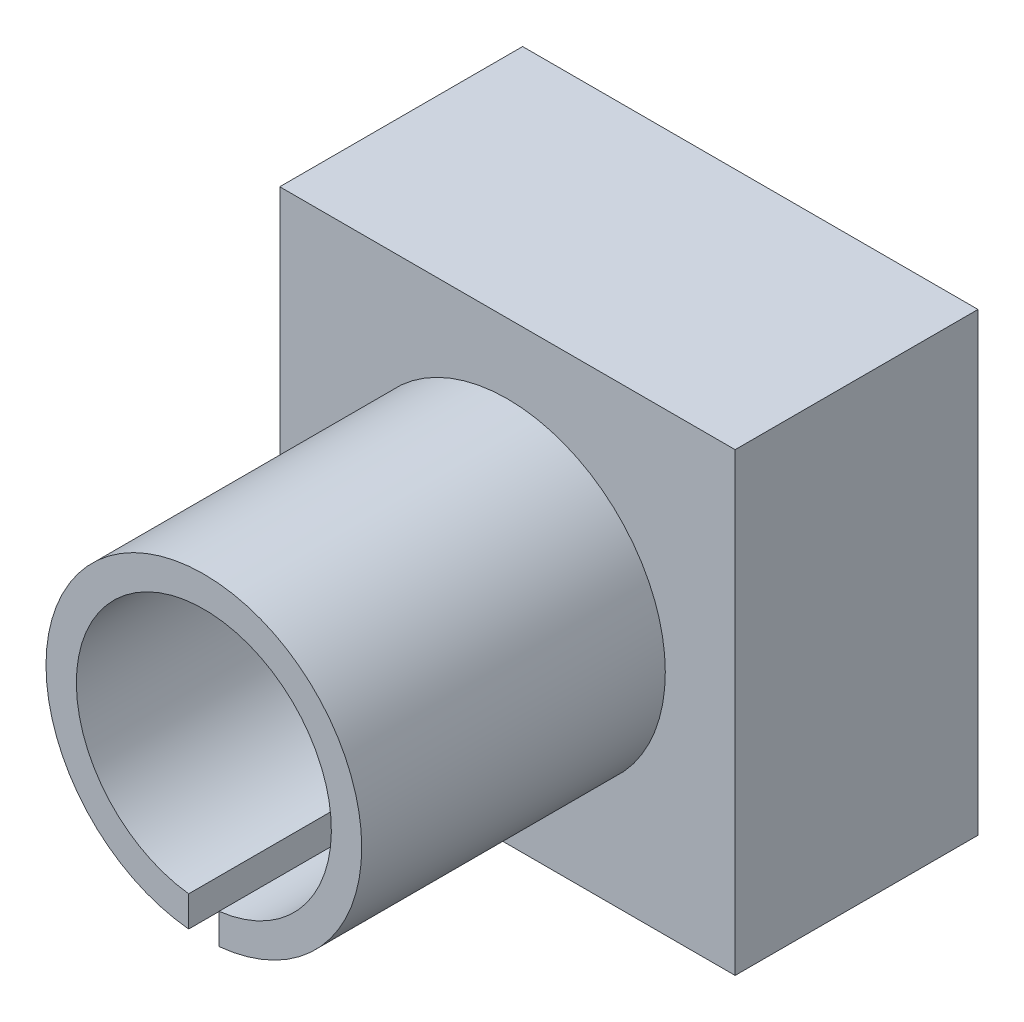
ISO-10303-21;
HEADER;
FILE_DESCRIPTION(('STEP AP214'),'2;1');
FILE_NAME('part.step','',(''),(''),'','','');
FILE_SCHEMA(('AUTOMOTIVE_DESIGN { 1 0 10303 214 1 1 1 1 }'));
ENDSEC;
DATA;
#1=APPLICATION_CONTEXT('core data for automotive mechanical design processes');
#2=APPLICATION_PROTOCOL_DEFINITION('international standard','automotive_design',2000,#1);
#3=PRODUCT_CONTEXT('',#1,'mechanical');
#4=PRODUCT('Part','Part','',(#3));
#5=PRODUCT_RELATED_PRODUCT_CATEGORY('part','',(#4));
#6=PRODUCT_DEFINITION_FORMATION('','',#4);
#7=PRODUCT_DEFINITION_CONTEXT('part definition',#1,'design');
#8=PRODUCT_DEFINITION('design','',#6,#7);
#9=PRODUCT_DEFINITION_SHAPE('','',#8);
#10=(LENGTH_UNIT() NAMED_UNIT(*) SI_UNIT(.MILLI.,.METRE.));
#11=(NAMED_UNIT(*) PLANE_ANGLE_UNIT() SI_UNIT($,.RADIAN.));
#12=(NAMED_UNIT(*) SI_UNIT($,.STERADIAN.) SOLID_ANGLE_UNIT());
#13=UNCERTAINTY_MEASURE_WITH_UNIT(LENGTH_MEASURE(1.E-05),#10,'distance_accuracy_value','');
#14=(GEOMETRIC_REPRESENTATION_CONTEXT(3) GLOBAL_UNCERTAINTY_ASSIGNED_CONTEXT((#13)) GLOBAL_UNIT_ASSIGNED_CONTEXT((#10,
#11,#12)) REPRESENTATION_CONTEXT('',''));
#15=CARTESIAN_POINT('',(0.,0.,0.));
#16=DIRECTION('',(0.,0.,1.));
#17=DIRECTION('',(1.,0.,0.));
#18=AXIS2_PLACEMENT_3D('',#15,#16,#17);
#19=CARTESIAN_POINT('',(0.,0.,10.001));
#20=DIRECTION('',(0.,0.,-1.));
#21=DIRECTION('',(-1.,0.,0.));
#22=AXIS2_PLACEMENT_3D('',#19,#20,#21);
#23=CYLINDRICAL_SURFACE('',#22,0.75);
#24=CARTESIAN_POINT('',(0.,0.,-1.59999999999998));
#25=DIRECTION('',(0.,0.,-1.));
#26=DIRECTION('',(-1.,0.,0.));
#27=AXIS2_PLACEMENT_3D('',#24,#25,#26);
#28=CIRCLE('',#27,0.75);
#29=CARTESIAN_POINT('',(-0.75,0.,-1.59999999999998));
#30=VERTEX_POINT('',#29);
#31=EDGE_CURVE('E55',#30,#30,#28,.T.);
#32=ORIENTED_EDGE('',*,*,#31,.T.);
#33=EDGE_LOOP('',(#32));
#34=FACE_BOUND('',#33,.T.);
#35=CARTESIAN_POINT('',(0.,0.,0.));
#36=DIRECTION('',(0.,0.,-1.));
#37=DIRECTION('',(-1.,0.,0.));
#38=AXIS2_PLACEMENT_3D('',#35,#36,#37);
#39=CIRCLE('',#38,0.75);
#40=CARTESIAN_POINT('',(-0.75,0.,0.));
#41=VERTEX_POINT('',#40);
#42=EDGE_CURVE('E364',#41,#41,#39,.F.);
#43=ORIENTED_EDGE('',*,*,#42,.T.);
#44=EDGE_LOOP('',(#43));
#45=FACE_BOUND('',#44,.T.);
#46=ADVANCED_FACE('F45',(#34,#45),#23,.F.);
#47=CARTESIAN_POINT('',(-7.5,-7.5,-8.));
#48=DIRECTION('',(0.,-1.,0.));
#49=DIRECTION('',(1.,0.,0.));
#50=AXIS2_PLACEMENT_3D('',#47,#48,#49);
#51=PLANE('',#50);
#52=DIRECTION('',(1.,0.,0.));
#53=VECTOR('',#52,1.);
#54=CARTESIAN_POINT('',(-7.5,-7.5,0.));
#55=LINE('',#54,#53);
#56=CARTESIAN_POINT('',(-7.5,-7.5,0.));
#57=VERTEX_POINT('',#56);
#58=CARTESIAN_POINT('',(7.5,-7.5,0.));
#59=VERTEX_POINT('',#58);
#60=EDGE_CURVE('E150',#57,#59,#55,.T.);
#61=ORIENTED_EDGE('',*,*,#60,.F.);
#62=DIRECTION('',(0.,0.,1.));
#63=VECTOR('',#62,1.);
#64=CARTESIAN_POINT('',(-7.5,-7.5,-8.));
#65=LINE('',#64,#63);
#66=CARTESIAN_POINT('',(-7.5,-7.5,-8.));
#67=VERTEX_POINT('',#66);
#68=EDGE_CURVE('E71',#67,#57,#65,.T.);
#69=ORIENTED_EDGE('',*,*,#68,.F.);
#70=DIRECTION('',(1.,0.,0.));
#71=VECTOR('',#70,1.);
#72=CARTESIAN_POINT('',(-7.5,-7.5,-8.));
#73=LINE('',#72,#71);
#74=CARTESIAN_POINT('',(7.5,-7.5,-8.));
#75=VERTEX_POINT('',#74);
#76=EDGE_CURVE('E157',#67,#75,#73,.T.);
#77=ORIENTED_EDGE('',*,*,#76,.T.);
#78=DIRECTION('',(0.,0.,1.));
#79=VECTOR('',#78,1.);
#80=CARTESIAN_POINT('',(7.5,-7.5,-8.));
#81=LINE('',#80,#79);
#82=EDGE_CURVE('E169',#75,#59,#81,.T.);
#83=ORIENTED_EDGE('',*,*,#82,.T.);
#84=EDGE_LOOP('',(#61,#69,#77,#83));
#85=FACE_BOUND('',#84,.T.);
#86=ADVANCED_FACE('F218',(#85),#51,.T.);
#87=CARTESIAN_POINT('',(-7.5,7.5,-8.));
#88=DIRECTION('',(-1.,0.,0.));
#89=DIRECTION('',(0.,-1.,0.));
#90=AXIS2_PLACEMENT_3D('',#87,#88,#89);
#91=PLANE('',#90);
#92=DIRECTION('',(0.,-1.,0.));
#93=VECTOR('',#92,1.);
#94=CARTESIAN_POINT('',(-7.5,7.5,0.));
#95=LINE('',#94,#93);
#96=CARTESIAN_POINT('',(-7.5,7.5,0.));
#97=VERTEX_POINT('',#96);
#98=EDGE_CURVE('E160',#97,#57,#95,.T.);
#99=ORIENTED_EDGE('',*,*,#98,.F.);
#100=DIRECTION('',(0.,0.,1.));
#101=VECTOR('',#100,1.);
#102=CARTESIAN_POINT('',(-7.5,7.5,-8.));
#103=LINE('',#102,#101);
#104=CARTESIAN_POINT('',(-7.5,7.5,-8.));
#105=VERTEX_POINT('',#104);
#106=EDGE_CURVE('E185',#105,#97,#103,.T.);
#107=ORIENTED_EDGE('',*,*,#106,.F.);
#108=DIRECTION('',(0.,-1.,0.));
#109=VECTOR('',#108,1.);
#110=CARTESIAN_POINT('',(-7.5,7.5,-8.));
#111=LINE('',#110,#109);
#112=EDGE_CURVE('E166',#105,#67,#111,.T.);
#113=ORIENTED_EDGE('',*,*,#112,.T.);
#114=ORIENTED_EDGE('',*,*,#68,.T.);
#115=EDGE_LOOP('',(#99,#107,#113,#114));
#116=FACE_BOUND('',#115,.T.);
#117=ADVANCED_FACE('F223',(#116),#91,.T.);
#118=CARTESIAN_POINT('',(-7.5,7.5,-8.));
#119=DIRECTION('',(0.,-1.,0.));
#120=DIRECTION('',(1.,0.,0.));
#121=AXIS2_PLACEMENT_3D('',#118,#119,#120);
#122=PLANE('',#121);
#123=DIRECTION('',(1.,0.,0.));
#124=VECTOR('',#123,1.);
#125=CARTESIAN_POINT('',(-7.5,7.5,0.));
#126=LINE('',#125,#124);
#127=CARTESIAN_POINT('',(7.5,7.5,0.));
#128=VERTEX_POINT('',#127);
#129=EDGE_CURVE('E177',#97,#128,#126,.T.);
#130=ORIENTED_EDGE('',*,*,#129,.T.);
#131=DIRECTION('',(0.,0.,1.));
#132=VECTOR('',#131,1.);
#133=CARTESIAN_POINT('',(7.5,7.5,-8.));
#134=LINE('',#133,#132);
#135=CARTESIAN_POINT('',(7.5,7.5,-8.));
#136=VERTEX_POINT('',#135);
#137=EDGE_CURVE('E188',#136,#128,#134,.T.);
#138=ORIENTED_EDGE('',*,*,#137,.F.);
#139=DIRECTION('',(1.,0.,0.));
#140=VECTOR('',#139,1.);
#141=CARTESIAN_POINT('',(-7.5,7.5,-8.));
#142=LINE('',#141,#140);
#143=EDGE_CURVE('E163',#105,#136,#142,.T.);
#144=ORIENTED_EDGE('',*,*,#143,.F.);
#145=ORIENTED_EDGE('',*,*,#106,.T.);
#146=EDGE_LOOP('',(#130,#138,#144,#145));
#147=FACE_BOUND('',#146,.T.);
#148=ADVANCED_FACE('F255',(#147),#122,.F.);
#149=CARTESIAN_POINT('',(7.5,7.5,-8.));
#150=DIRECTION('',(-1.,0.,0.));
#151=DIRECTION('',(0.,-1.,0.));
#152=AXIS2_PLACEMENT_3D('',#149,#150,#151);
#153=PLANE('',#152);
#154=DIRECTION('',(0.,-1.,0.));
#155=VECTOR('',#154,1.);
#156=CARTESIAN_POINT('',(7.5,7.5,0.));
#157=LINE('',#156,#155);
#158=EDGE_CURVE('E173',#128,#59,#157,.T.);
#159=ORIENTED_EDGE('',*,*,#158,.T.);
#160=ORIENTED_EDGE('',*,*,#82,.F.);
#161=DIRECTION('',(0.,-1.,0.));
#162=VECTOR('',#161,1.);
#163=CARTESIAN_POINT('',(7.5,7.5,-8.));
#164=LINE('',#163,#162);
#165=EDGE_CURVE('E97',#136,#75,#164,.T.);
#166=ORIENTED_EDGE('',*,*,#165,.F.);
#167=ORIENTED_EDGE('',*,*,#137,.T.);
#168=EDGE_LOOP('',(#159,#160,#166,#167));
#169=FACE_BOUND('',#168,.T.);
#170=ADVANCED_FACE('F248',(#169),#153,.F.);
#171=CARTESIAN_POINT('',(0.,0.,-8.));
#172=DIRECTION('',(0.,0.,-1.));
#173=DIRECTION('',(-1.,0.,0.));
#174=AXIS2_PLACEMENT_3D('',#171,#172,#173);
#175=PLANE('',#174);
#176=CARTESIAN_POINT('',(0.,0.,-8.));
#177=DIRECTION('',(0.,0.,-1.));
#178=DIRECTION('',(-1.,0.,0.));
#179=AXIS2_PLACEMENT_3D('',#176,#177,#178);
#180=CIRCLE('',#179,2.1);
#181=CARTESIAN_POINT('',(-2.1,0.,-8.));
#182=VERTEX_POINT('',#181);
#183=EDGE_CURVE('E368',#182,#182,#180,.T.);
#184=ORIENTED_EDGE('',*,*,#183,.F.);
#185=EDGE_LOOP('',(#184));
#186=FACE_BOUND('',#185,.T.);
#187=ORIENTED_EDGE('',*,*,#76,.F.);
#188=ORIENTED_EDGE('',*,*,#112,.F.);
#189=ORIENTED_EDGE('',*,*,#143,.T.);
#190=ORIENTED_EDGE('',*,*,#165,.T.);
#191=EDGE_LOOP('',(#187,#188,#189,#190));
#192=FACE_BOUND('',#191,.T.);
#193=ADVANCED_FACE('F245',(#186,#192),#175,.T.);
#194=CARTESIAN_POINT('',(0.,0.,0.));
#195=DIRECTION('',(0.,0.,-1.));
#196=DIRECTION('',(-1.,0.,0.));
#197=AXIS2_PLACEMENT_3D('',#194,#195,#196);
#198=PLANE('',#197);
#199=CARTESIAN_POINT('',(0.,0.,0.));
#200=DIRECTION('',(0.,0.,-1.));
#201=DIRECTION('',(-1.,0.,0.));
#202=AXIS2_PLACEMENT_3D('',#199,#200,#201);
#203=CIRCLE('',#202,5.2);
#204=CARTESIAN_POINT('',(-5.2,0.,0.));
#205=VERTEX_POINT('',#204);
#206=EDGE_CURVE('E129',#205,#205,#203,.F.);
#207=ORIENTED_EDGE('',*,*,#206,.F.);
#208=EDGE_LOOP('',(#207));
#209=FACE_BOUND('',#208,.T.);
#210=ORIENTED_EDGE('',*,*,#60,.T.);
#211=ORIENTED_EDGE('',*,*,#158,.F.);
#212=ORIENTED_EDGE('',*,*,#129,.F.);
#213=ORIENTED_EDGE('',*,*,#98,.T.);
#214=EDGE_LOOP('',(#210,#211,#212,#213));
#215=FACE_BOUND('',#214,.T.);
#216=ADVANCED_FACE('F244',(#209,#215),#198,.F.);
#217=CARTESIAN_POINT('',(0.,0.,10.));
#218=DIRECTION('',(0.,0.,-1.));
#219=DIRECTION('',(-1.,0.,0.));
#220=AXIS2_PLACEMENT_3D('',#217,#218,#219);
#221=CYLINDRICAL_SURFACE('',#220,4.2);
#222=DIRECTION('',(0.,0.,-1.));
#223=VECTOR('',#222,1.);
#224=CARTESIAN_POINT('',(-0.5,-4.17013189239861,10.));
#225=LINE('',#224,#223);
#226=CARTESIAN_POINT('',(-0.5,-4.17013189239861,3.));
#227=VERTEX_POINT('',#226);
#228=CARTESIAN_POINT('',(-0.5,-4.17013189239861,10.));
#229=VERTEX_POINT('',#228);
#230=EDGE_CURVE('E384',#227,#229,#225,.F.);
#231=ORIENTED_EDGE('',*,*,#230,.F.);
#232=CARTESIAN_POINT('',(0.,0.,3.));
#233=DIRECTION('',(0.,0.,-1.));
#234=DIRECTION('',(-1.,0.,0.));
#235=AXIS2_PLACEMENT_3D('',#232,#233,#234);
#236=CIRCLE('',#235,4.2);
#237=CARTESIAN_POINT('',(0.5,-4.17013189239861,3.));
#238=VERTEX_POINT('',#237);
#239=EDGE_CURVE('E138',#238,#227,#236,.T.);
#240=ORIENTED_EDGE('',*,*,#239,.F.);
#241=DIRECTION('',(0.,0.,-1.));
#242=VECTOR('',#241,1.);
#243=CARTESIAN_POINT('',(0.5,-4.17013189239861,10.));
#244=LINE('',#243,#242);
#245=CARTESIAN_POINT('',(0.5,-4.17013189239861,10.));
#246=VERTEX_POINT('',#245);
#247=EDGE_CURVE('E121',#246,#238,#244,.T.);
#248=ORIENTED_EDGE('',*,*,#247,.F.);
#249=CARTESIAN_POINT('',(0.,0.,10.));
#250=DIRECTION('',(0.,0.,1.));
#251=DIRECTION('',(1.,0.,0.));
#252=AXIS2_PLACEMENT_3D('',#249,#250,#251);
#253=CIRCLE('',#252,4.2);
#254=EDGE_CURVE('E137',#246,#229,#253,.T.);
#255=ORIENTED_EDGE('',*,*,#254,.T.);
#256=EDGE_LOOP('',(#231,#240,#248,#255));
#257=FACE_BOUND('',#256,.T.);
#258=CARTESIAN_POINT('',(0.,0.,0.));
#259=DIRECTION('',(0.,0.,1.));
#260=DIRECTION('',(1.,0.,0.));
#261=AXIS2_PLACEMENT_3D('',#258,#259,#260);
#262=CIRCLE('',#261,4.2);
#263=CARTESIAN_POINT('',(4.2,0.,0.));
#264=VERTEX_POINT('',#263);
#265=EDGE_CURVE('E146',#264,#264,#262,.T.);
#266=ORIENTED_EDGE('',*,*,#265,.F.);
#267=EDGE_LOOP('',(#266));
#268=FACE_BOUND('',#267,.T.);
#269=ADVANCED_FACE('F135',(#257,#268),#221,.F.);
#270=CARTESIAN_POINT('',(0.,0.,10.));
#271=DIRECTION('',(0.,0.,-1.));
#272=DIRECTION('',(-1.,0.,0.));
#273=AXIS2_PLACEMENT_3D('',#270,#271,#272);
#274=CYLINDRICAL_SURFACE('',#273,5.2);
#275=CARTESIAN_POINT('',(0.,0.,3.));
#276=DIRECTION('',(0.,0.,-1.));
#277=DIRECTION('',(-1.,0.,0.));
#278=AXIS2_PLACEMENT_3D('',#275,#276,#277);
#279=CIRCLE('',#278,5.2);
#280=CARTESIAN_POINT('',(0.5,-5.17590571784301,3.));
#281=VERTEX_POINT('',#280);
#282=CARTESIAN_POINT('',(-0.5,-5.17590571784301,3.));
#283=VERTEX_POINT('',#282);
#284=EDGE_CURVE('E199',#281,#283,#279,.T.);
#285=ORIENTED_EDGE('',*,*,#284,.T.);
#286=DIRECTION('',(0.,0.,-1.));
#287=VECTOR('',#286,1.);
#288=CARTESIAN_POINT('',(-0.5,-5.17590571784301,10.));
#289=LINE('',#288,#287);
#290=CARTESIAN_POINT('',(-0.5,-5.17590571784301,10.));
#291=VERTEX_POINT('',#290);
#292=EDGE_CURVE('E140',#283,#291,#289,.F.);
#293=ORIENTED_EDGE('',*,*,#292,.T.);
#294=CARTESIAN_POINT('',(0.,0.,10.));
#295=DIRECTION('',(0.,0.,1.));
#296=DIRECTION('',(1.,0.,0.));
#297=AXIS2_PLACEMENT_3D('',#294,#295,#296);
#298=CIRCLE('',#297,5.2);
#299=CARTESIAN_POINT('',(0.5,-5.17590571784301,10.));
#300=VERTEX_POINT('',#299);
#301=EDGE_CURVE('E145',#300,#291,#298,.T.);
#302=ORIENTED_EDGE('',*,*,#301,.F.);
#303=DIRECTION('',(0.,0.,-1.));
#304=VECTOR('',#303,1.);
#305=CARTESIAN_POINT('',(0.5,-5.17590571784301,10.));
#306=LINE('',#305,#304);
#307=EDGE_CURVE('E62',#300,#281,#306,.T.);
#308=ORIENTED_EDGE('',*,*,#307,.T.);
#309=EDGE_LOOP('',(#285,#293,#302,#308));
#310=FACE_BOUND('',#309,.T.);
#311=ORIENTED_EDGE('',*,*,#206,.T.);
#312=EDGE_LOOP('',(#311));
#313=FACE_BOUND('',#312,.T.);
#314=ADVANCED_FACE('F238',(#310,#313),#274,.T.);
#315=CARTESIAN_POINT('',(0.,0.,10.));
#316=DIRECTION('',(0.,0.,1.));
#317=DIRECTION('',(1.,0.,0.));
#318=AXIS2_PLACEMENT_3D('',#315,#316,#317);
#319=PLANE('',#318);
#320=DIRECTION('',(0.,-1.,0.));
#321=VECTOR('',#320,1.);
#322=CARTESIAN_POINT('',(-0.5,0.,10.));
#323=LINE('',#322,#321);
#324=EDGE_CURVE('E128',#229,#291,#323,.T.);
#325=ORIENTED_EDGE('',*,*,#324,.F.);
#326=ORIENTED_EDGE('',*,*,#254,.F.);
#327=DIRECTION('',(0.,1.,0.));
#328=VECTOR('',#327,1.);
#329=CARTESIAN_POINT('',(0.5,0.,10.));
#330=LINE('',#329,#328);
#331=EDGE_CURVE('E118',#300,#246,#330,.T.);
#332=ORIENTED_EDGE('',*,*,#331,.F.);
#333=ORIENTED_EDGE('',*,*,#301,.T.);
#334=EDGE_LOOP('',(#325,#326,#332,#333));
#335=FACE_BOUND('',#334,.T.);
#336=ADVANCED_FACE('F143',(#335),#319,.T.);
#337=ORIENTED_EDGE('',*,*,#42,.F.);
#338=EDGE_LOOP('',(#337));
#339=FACE_BOUND('',#338,.T.);
#340=ORIENTED_EDGE('',*,*,#265,.T.);
#341=EDGE_LOOP('',(#340));
#342=FACE_BOUND('',#341,.T.);
#343=ADVANCED_FACE('F229',(#339,#342),#198,.F.);
#344=CARTESIAN_POINT('',(-0.5,-10.,3.));
#345=DIRECTION('',(0.,0.,-1.));
#346=DIRECTION('',(-1.,0.,0.));
#347=AXIS2_PLACEMENT_3D('',#344,#345,#346);
#348=PLANE('',#347);
#349=ORIENTED_EDGE('',*,*,#239,.T.);
#350=DIRECTION('',(0.,1.,0.));
#351=VECTOR('',#350,1.);
#352=CARTESIAN_POINT('',(-0.5,-10.,3.));
#353=LINE('',#352,#351);
#354=EDGE_CURVE('E372',#283,#227,#353,.T.);
#355=ORIENTED_EDGE('',*,*,#354,.F.);
#356=ORIENTED_EDGE('',*,*,#284,.F.);
#357=DIRECTION('',(0.,1.,0.));
#358=VECTOR('',#357,1.);
#359=CARTESIAN_POINT('',(0.5,-10.,3.));
#360=LINE('',#359,#358);
#361=EDGE_CURVE('E367',#281,#238,#360,.T.);
#362=ORIENTED_EDGE('',*,*,#361,.T.);
#363=EDGE_LOOP('',(#349,#355,#356,#362));
#364=FACE_BOUND('',#363,.T.);
#365=ADVANCED_FACE('F225',(#364),#348,.F.);
#366=CARTESIAN_POINT('',(-0.5,-10.,10.));
#367=DIRECTION('',(-1.,0.,0.));
#368=DIRECTION('',(0.,0.,1.));
#369=AXIS2_PLACEMENT_3D('',#366,#367,#368);
#370=PLANE('',#369);
#371=ORIENTED_EDGE('',*,*,#230,.T.);
#372=ORIENTED_EDGE('',*,*,#324,.T.);
#373=ORIENTED_EDGE('',*,*,#292,.F.);
#374=ORIENTED_EDGE('',*,*,#354,.T.);
#375=EDGE_LOOP('',(#371,#372,#373,#374));
#376=FACE_BOUND('',#375,.T.);
#377=ADVANCED_FACE('F228',(#376),#370,.F.);
#378=CARTESIAN_POINT('',(0.5,-10.,10.));
#379=DIRECTION('',(1.,0.,0.));
#380=DIRECTION('',(0.,0.,-1.));
#381=AXIS2_PLACEMENT_3D('',#378,#379,#380);
#382=PLANE('',#381);
#383=ORIENTED_EDGE('',*,*,#247,.T.);
#384=ORIENTED_EDGE('',*,*,#361,.F.);
#385=ORIENTED_EDGE('',*,*,#307,.F.);
#386=ORIENTED_EDGE('',*,*,#331,.T.);
#387=EDGE_LOOP('',(#383,#384,#385,#386));
#388=FACE_BOUND('',#387,.T.);
#389=ADVANCED_FACE('F120',(#388),#382,.F.);
#390=CARTESIAN_POINT('',(0.,0.,-3.));
#391=DIRECTION('',(0.,0.,-1.));
#392=DIRECTION('',(-1.,0.,0.));
#393=AXIS2_PLACEMENT_3D('',#390,#391,#392);
#394=CYLINDRICAL_SURFACE('',#393,2.1);
#395=CARTESIAN_POINT('',(0.,0.,-2.94999999999999));
#396=DIRECTION('',(0.,0.,-1.));
#397=DIRECTION('',(-1.,0.,0.));
#398=AXIS2_PLACEMENT_3D('',#395,#396,#397);
#399=CIRCLE('',#398,2.1);
#400=CARTESIAN_POINT('',(-2.1,0.,-2.94999999999999));
#401=VERTEX_POINT('',#400);
#402=EDGE_CURVE('E11',#401,#401,#399,.F.);
#403=ORIENTED_EDGE('',*,*,#402,.T.);
#404=EDGE_LOOP('',(#403));
#405=FACE_BOUND('',#404,.T.);
#406=ORIENTED_EDGE('',*,*,#183,.T.);
#407=EDGE_LOOP('',(#406));
#408=FACE_BOUND('',#407,.T.);
#409=ADVANCED_FACE('F209',(#405,#408),#394,.F.);
#410=CARTESIAN_POINT('',(0.,0.,-1.59999999999998));
#411=DIRECTION('',(0.,0.,-1.));
#412=DIRECTION('',(-1.,0.,0.));
#413=AXIS2_PLACEMENT_3D('',#410,#411,#412);
#414=CONICAL_SURFACE('',#413,0.75,0.785398163397444);
#415=CARTESIAN_POINT('',(-2.1,0.,-2.94999999999999));
#416=CARTESIAN_POINT('',(-2.0859375,0.,-2.93593749999999));
#417=CARTESIAN_POINT('',(-2.071875,0.,-2.92187499999999));
#418=CARTESIAN_POINT('',(-2.04375,0.,-2.89374999999999));
#419=CARTESIAN_POINT('',(-2.0296875,0.,-2.87968749999999));
#420=CARTESIAN_POINT('',(-2.0015625,0.,-2.85156249999999));
#421=CARTESIAN_POINT('',(-1.9875,0.,-2.83749999999999));
#422=CARTESIAN_POINT('',(-1.959375,0.,-2.80937499999999));
#423=CARTESIAN_POINT('',(-1.9453125,0.,-2.79531249999999));
#424=CARTESIAN_POINT('',(-1.9171875,0.,-2.76718749999999));
#425=CARTESIAN_POINT('',(-1.903125,0.,-2.75312499999999));
#426=CARTESIAN_POINT('',(-1.875,0.,-2.72499999999999));
#427=CARTESIAN_POINT('',(-1.8609375,0.,-2.71093749999999));
#428=CARTESIAN_POINT('',(-1.8328125,0.,-2.68281249999999));
#429=CARTESIAN_POINT('',(-1.81875,0.,-2.66874999999999));
#430=CARTESIAN_POINT('',(-1.790625,0.,-2.64062499999998));
#431=CARTESIAN_POINT('',(-1.7765625,0.,-2.62656249999998));
#432=CARTESIAN_POINT('',(-1.7484375,0.,-2.59843749999998));
#433=CARTESIAN_POINT('',(-1.734375,0.,-2.58437499999998));
#434=CARTESIAN_POINT('',(-1.70625,0.,-2.55624999999998));
#435=CARTESIAN_POINT('',(-1.6921875,0.,-2.54218749999998));
#436=CARTESIAN_POINT('',(-1.6640625,0.,-2.51406249999998));
#437=CARTESIAN_POINT('',(-1.65,0.,-2.49999999999998));
#438=CARTESIAN_POINT('',(-1.621875,0.,-2.47187499999998));
#439=CARTESIAN_POINT('',(-1.6078125,0.,-2.45781249999998));
#440=CARTESIAN_POINT('',(-1.5796875,0.,-2.42968749999998));
#441=CARTESIAN_POINT('',(-1.565625,0.,-2.41562499999998));
#442=CARTESIAN_POINT('',(-1.5375,0.,-2.38749999999998));
#443=CARTESIAN_POINT('',(-1.5234375,0.,-2.37343749999998));
#444=CARTESIAN_POINT('',(-1.4953125,0.,-2.34531249999998));
#445=CARTESIAN_POINT('',(-1.48125,0.,-2.33124999999998));
#446=CARTESIAN_POINT('',(-1.453125,0.,-2.30312499999998));
#447=CARTESIAN_POINT('',(-1.4390625,0.,-2.28906249999998));
#448=CARTESIAN_POINT('',(-1.4109375,0.,-2.26093749999998));
#449=CARTESIAN_POINT('',(-1.396875,0.,-2.24687499999998));
#450=CARTESIAN_POINT('',(-1.36875,0.,-2.21874999999998));
#451=CARTESIAN_POINT('',(-1.3546875,0.,-2.20468749999998));
#452=CARTESIAN_POINT('',(-1.3265625,0.,-2.17656249999998));
#453=CARTESIAN_POINT('',(-1.3125,0.,-2.16249999999998));
#454=CARTESIAN_POINT('',(-1.284375,0.,-2.13437499999998));
#455=CARTESIAN_POINT('',(-1.2703125,0.,-2.12031249999998));
#456=CARTESIAN_POINT('',(-1.2421875,0.,-2.09218749999998));
#457=CARTESIAN_POINT('',(-1.228125,0.,-2.07812499999998));
#458=CARTESIAN_POINT('',(-1.2,0.,-2.04999999999998));
#459=CARTESIAN_POINT('',(-1.1859375,0.,-2.03593749999998));
#460=CARTESIAN_POINT('',(-1.1578125,0.,-2.00781249999998));
#461=CARTESIAN_POINT('',(-1.14375,0.,-1.99374999999998));
#462=CARTESIAN_POINT('',(-1.115625,0.,-1.96562499999998));
#463=CARTESIAN_POINT('',(-1.1015625,0.,-1.95156249999998));
#464=CARTESIAN_POINT('',(-1.0734375,0.,-1.92343749999998));
#465=CARTESIAN_POINT('',(-1.059375,0.,-1.90937499999998));
#466=CARTESIAN_POINT('',(-1.03125,0.,-1.88124999999998));
#467=CARTESIAN_POINT('',(-1.0171875,0.,-1.86718749999998));
#468=CARTESIAN_POINT('',(-0.9890625,0.,-1.83906249999998));
#469=CARTESIAN_POINT('',(-0.975,0.,-1.82499999999998));
#470=CARTESIAN_POINT('',(-0.946875,0.,-1.79687499999998));
#471=CARTESIAN_POINT('',(-0.9328125,0.,-1.78281249999998));
#472=CARTESIAN_POINT('',(-0.9046875,0.,-1.75468749999998));
#473=CARTESIAN_POINT('',(-0.890625,0.,-1.74062499999998));
#474=CARTESIAN_POINT('',(-0.8625,0.,-1.71249999999998));
#475=CARTESIAN_POINT('',(-0.8484375,0.,-1.69843749999998));
#476=CARTESIAN_POINT('',(-0.8203125,0.,-1.67031249999998));
#477=CARTESIAN_POINT('',(-0.80625,0.,-1.65624999999998));
#478=CARTESIAN_POINT('',(-0.778125,0.,-1.62812499999998));
#479=CARTESIAN_POINT('',(-0.7640625,0.,-1.61406249999998));
#480=CARTESIAN_POINT('',(-0.75,0.,-1.59999999999998));
#481=B_SPLINE_CURVE_WITH_KNOTS('',3,(#415,#416,#417,#418,#419,#420,#421,#422,#423,#424,#425,
#426,#427,#428,#429,#430,#431,#432,#433,#434,#435,#436,#437,#438,#439,#440,#441,#442,#443,#444,
#445,#446,#447,#448,#449,#450,#451,#452,#453,#454,#455,#456,#457,#458,#459,#460,#461,#462,#463,
#464,#465,#466,#467,#468,#469,#470,#471,#472,#473,#474,#475,#476,#477,#478,#479,#480),
.UNSPECIFIED.,.F.,.F.,(4,2,2,2,2,2,2,2,2,2,2,2,2,2,2,2,2,2,2,2,2,2,2,2,2,2,2,2,2,2,2,2,4),(0.,
0.0596621346626148,0.11932426932523,0.178986403987845,0.23864853865046,0.298310673313076,
0.35797280797569,0.417634942638306,0.477297077300921,0.536959211963536,0.596621346626151,
0.656283481288767,0.715945615951382,0.775607750613997,0.835269885276612,0.894932019939227,
0.954594154601843,1.01425628926446,1.07391842392707,1.13358055858969,1.1932426932523,
1.25290482791492,1.31256696257753,1.37222909724015,1.43189123190276,1.49155336656538,
1.55121550122799,1.61087763589061,1.67053977055322,1.73020190521584,1.78986403987846,
1.84952617454107,1.90918830920369),.UNSPECIFIED.);
#482=EDGE_CURVE('BSEAM48',#401,#30,#481,.T.);
#483=ORIENTED_EDGE('',*,*,#402,.F.);
#484=ORIENTED_EDGE('',*,*,#31,.F.);
#485=ORIENTED_EDGE('',*,*,#482,.T.);
#486=ORIENTED_EDGE('',*,*,#482,.F.);
#487=EDGE_LOOP('',(#483,#485,#484,#486));
#488=FACE_BOUND('',#487,.T.);
#489=ADVANCED_FACE('F48',(#488),#414,.F.);
#490=CLOSED_SHELL('',(#46,#86,#117,#148,#170,#193,#216,#269,#314,#336,#343,#365,#377,#389,#409,#489));
#491=MANIFOLD_SOLID_BREP('B2',#490);
#492=ADVANCED_BREP_SHAPE_REPRESENTATION('',(#18,#491),#14);
#493=SHAPE_DEFINITION_REPRESENTATION(#9,#492);
ENDSEC;
END-ISO-10303-21;
